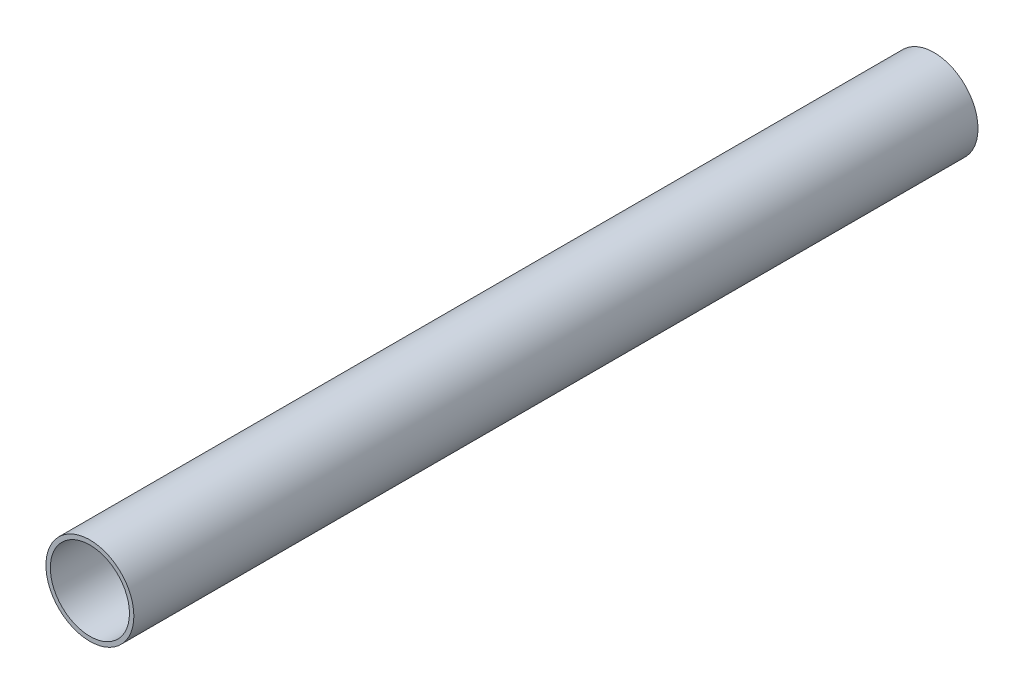
ISO-10303-21;
HEADER;
FILE_DESCRIPTION(('STEP AP214'),'2;1');
FILE_NAME('part.step','',(''),(''),'','','');
FILE_SCHEMA(('AUTOMOTIVE_DESIGN { 1 0 10303 214 1 1 1 1 }'));
ENDSEC;
DATA;
#1=APPLICATION_CONTEXT('core data for automotive mechanical design processes');
#2=APPLICATION_PROTOCOL_DEFINITION('international standard','automotive_design',2000,#1);
#3=PRODUCT_CONTEXT('',#1,'mechanical');
#4=PRODUCT('Part','Part','',(#3));
#5=PRODUCT_RELATED_PRODUCT_CATEGORY('part','',(#4));
#6=PRODUCT_DEFINITION_FORMATION('','',#4);
#7=PRODUCT_DEFINITION_CONTEXT('part definition',#1,'design');
#8=PRODUCT_DEFINITION('design','',#6,#7);
#9=PRODUCT_DEFINITION_SHAPE('','',#8);
#10=(LENGTH_UNIT() NAMED_UNIT(*) SI_UNIT(.MILLI.,.METRE.));
#11=(NAMED_UNIT(*) PLANE_ANGLE_UNIT() SI_UNIT($,.RADIAN.));
#12=(NAMED_UNIT(*) SI_UNIT($,.STERADIAN.) SOLID_ANGLE_UNIT());
#13=UNCERTAINTY_MEASURE_WITH_UNIT(LENGTH_MEASURE(1.E-05),#10,'distance_accuracy_value','');
#14=(GEOMETRIC_REPRESENTATION_CONTEXT(3) GLOBAL_UNCERTAINTY_ASSIGNED_CONTEXT((#13)) GLOBAL_UNIT_ASSIGNED_CONTEXT((#10,
#11,#12)) REPRESENTATION_CONTEXT('',''));
#15=CARTESIAN_POINT('',(0.,0.,0.));
#16=DIRECTION('',(0.,0.,1.));
#17=DIRECTION('',(1.,0.,0.));
#18=AXIS2_PLACEMENT_3D('',#15,#16,#17);
#19=CARTESIAN_POINT('',(0.,0.,609.6));
#20=DIRECTION('',(0.,0.,1.));
#21=DIRECTION('',(1.,0.,0.));
#22=AXIS2_PLACEMENT_3D('',#19,#20,#21);
#23=PLANE('',#22);
#24=CARTESIAN_POINT('',(0.,0.,609.6));
#25=DIRECTION('',(0.,0.,1.));
#26=DIRECTION('',(1.,0.,0.));
#27=AXIS2_PLACEMENT_3D('',#24,#25,#26);
#28=CIRCLE('',#27,31.75);
#29=CARTESIAN_POINT('',(31.75,0.,609.6));
#30=VERTEX_POINT('',#29);
#31=EDGE_CURVE('E10',#30,#30,#28,.T.);
#32=ORIENTED_EDGE('',*,*,#31,.T.);
#33=EDGE_LOOP('',(#32));
#34=FACE_BOUND('',#33,.T.);
#35=CARTESIAN_POINT('',(0.,0.,609.6));
#36=DIRECTION('',(0.,0.,1.));
#37=DIRECTION('',(1.,0.,0.));
#38=AXIS2_PLACEMENT_3D('',#35,#36,#37);
#39=CIRCLE('',#38,28.575);
#40=CARTESIAN_POINT('',(28.575,0.,609.6));
#41=VERTEX_POINT('',#40);
#42=EDGE_CURVE('E56',#41,#41,#39,.T.);
#43=ORIENTED_EDGE('',*,*,#42,.F.);
#44=EDGE_LOOP('',(#43));
#45=FACE_BOUND('',#44,.T.);
#46=ADVANCED_FACE('F43',(#34,#45),#23,.T.);
#47=CARTESIAN_POINT('',(0.,0.,0.));
#48=DIRECTION('',(0.,0.,1.));
#49=DIRECTION('',(1.,0.,0.));
#50=AXIS2_PLACEMENT_3D('',#47,#48,#49);
#51=PLANE('',#50);
#52=CARTESIAN_POINT('',(0.,0.,0.));
#53=DIRECTION('',(0.,0.,1.));
#54=DIRECTION('',(1.,0.,0.));
#55=AXIS2_PLACEMENT_3D('',#52,#53,#54);
#56=CIRCLE('',#55,31.75);
#57=CARTESIAN_POINT('',(31.75,0.,0.));
#58=VERTEX_POINT('',#57);
#59=EDGE_CURVE('E47',#58,#58,#56,.T.);
#60=ORIENTED_EDGE('',*,*,#59,.F.);
#61=EDGE_LOOP('',(#60));
#62=FACE_BOUND('',#61,.T.);
#63=CARTESIAN_POINT('',(0.,0.,0.));
#64=DIRECTION('',(0.,0.,1.));
#65=DIRECTION('',(1.,0.,0.));
#66=AXIS2_PLACEMENT_3D('',#63,#64,#65);
#67=CIRCLE('',#66,28.575);
#68=CARTESIAN_POINT('',(28.575,0.,0.));
#69=VERTEX_POINT('',#68);
#70=EDGE_CURVE('E58',#69,#69,#67,.T.);
#71=ORIENTED_EDGE('',*,*,#70,.T.);
#72=EDGE_LOOP('',(#71));
#73=FACE_BOUND('',#72,.T.);
#74=ADVANCED_FACE('F70',(#62,#73),#51,.F.);
#75=CARTESIAN_POINT('',(0.,0.,609.6));
#76=DIRECTION('',(0.,0.,-1.));
#77=DIRECTION('',(-1.,0.,0.));
#78=AXIS2_PLACEMENT_3D('',#75,#76,#77);
#79=CYLINDRICAL_SURFACE('',#78,31.75);
#80=ORIENTED_EDGE('',*,*,#31,.F.);
#81=EDGE_LOOP('',(#80));
#82=FACE_BOUND('',#81,.T.);
#83=ORIENTED_EDGE('',*,*,#59,.T.);
#84=EDGE_LOOP('',(#83));
#85=FACE_BOUND('',#84,.T.);
#86=ADVANCED_FACE('F45',(#82,#85),#79,.T.);
#87=CARTESIAN_POINT('',(0.,0.,609.6));
#88=DIRECTION('',(0.,0.,-1.));
#89=DIRECTION('',(-1.,0.,0.));
#90=AXIS2_PLACEMENT_3D('',#87,#88,#89);
#91=CYLINDRICAL_SURFACE('',#90,28.575);
#92=ORIENTED_EDGE('',*,*,#42,.T.);
#93=EDGE_LOOP('',(#92));
#94=FACE_BOUND('',#93,.T.);
#95=ORIENTED_EDGE('',*,*,#70,.F.);
#96=EDGE_LOOP('',(#95));
#97=FACE_BOUND('',#96,.T.);
#98=ADVANCED_FACE('F66',(#94,#97),#91,.F.);
#99=CLOSED_SHELL('',(#46,#74,#86,#98));
#100=MANIFOLD_SOLID_BREP('B2',#99);
#101=ADVANCED_BREP_SHAPE_REPRESENTATION('',(#18,#100),#14);
#102=SHAPE_DEFINITION_REPRESENTATION(#9,#101);
ENDSEC;
END-ISO-10303-21;
